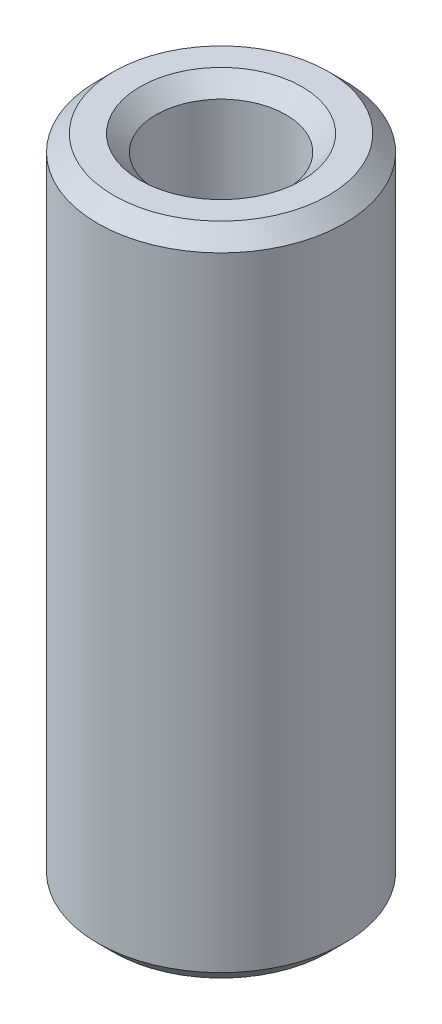
ISO-10303-21;
HEADER;
FILE_DESCRIPTION(('STEP AP214'),'2;1');
FILE_NAME('part.step','',(''),(''),'','','');
FILE_SCHEMA(('AUTOMOTIVE_DESIGN { 1 0 10303 214 1 1 1 1 }'));
ENDSEC;
DATA;
#1=APPLICATION_CONTEXT('core data for automotive mechanical design processes');
#2=APPLICATION_PROTOCOL_DEFINITION('international standard','automotive_design',2000,#1);
#3=PRODUCT_CONTEXT('',#1,'mechanical');
#4=PRODUCT('Part','Part','',(#3));
#5=PRODUCT_RELATED_PRODUCT_CATEGORY('part','',(#4));
#6=PRODUCT_DEFINITION_FORMATION('','',#4);
#7=PRODUCT_DEFINITION_CONTEXT('part definition',#1,'design');
#8=PRODUCT_DEFINITION('design','',#6,#7);
#9=PRODUCT_DEFINITION_SHAPE('','',#8);
#10=(LENGTH_UNIT() NAMED_UNIT(*) SI_UNIT(.MILLI.,.METRE.));
#11=(NAMED_UNIT(*) PLANE_ANGLE_UNIT() SI_UNIT($,.RADIAN.));
#12=(NAMED_UNIT(*) SI_UNIT($,.STERADIAN.) SOLID_ANGLE_UNIT());
#13=UNCERTAINTY_MEASURE_WITH_UNIT(LENGTH_MEASURE(1.E-05),#10,'distance_accuracy_value','');
#14=(GEOMETRIC_REPRESENTATION_CONTEXT(3) GLOBAL_UNCERTAINTY_ASSIGNED_CONTEXT((#13)) GLOBAL_UNIT_ASSIGNED_CONTEXT((#10,
#11,#12)) REPRESENTATION_CONTEXT('',''));
#15=CARTESIAN_POINT('',(0.,0.,0.));
#16=DIRECTION('',(0.,0.,1.));
#17=DIRECTION('',(1.,0.,0.));
#18=AXIS2_PLACEMENT_3D('',#15,#16,#17);
#19=CARTESIAN_POINT('',(0.,106.196778002073,0.));
#20=DIRECTION('',(0.,-1.,0.));
#21=DIRECTION('',(0.,0.,-1.));
#22=AXIS2_PLACEMENT_3D('',#19,#20,#21);
#23=CYLINDRICAL_SURFACE('',#22,20.);
#24=CARTESIAN_POINT('',(0.,2.61229125032107,0.));
#25=DIRECTION('',(0.,1.,0.));
#26=DIRECTION('',(0.,0.,1.));
#27=AXIS2_PLACEMENT_3D('',#24,#25,#26);
#28=CIRCLE('',#27,20.);
#29=CARTESIAN_POINT('',(0.,2.61229125032107,20.));
#30=VERTEX_POINT('',#29);
#31=EDGE_CURVE('E10',#30,#30,#28,.T.);
#32=ORIENTED_EDGE('',*,*,#31,.T.);
#33=EDGE_LOOP('',(#32));
#34=FACE_BOUND('',#33,.T.);
#35=CARTESIAN_POINT('',(0.,103.584486751752,0.));
#36=DIRECTION('',(0.,1.,0.));
#37=DIRECTION('',(0.,0.,1.));
#38=AXIS2_PLACEMENT_3D('',#35,#36,#37);
#39=CIRCLE('',#38,20.);
#40=CARTESIAN_POINT('',(0.,103.584486751752,20.));
#41=VERTEX_POINT('',#40);
#42=EDGE_CURVE('E50',#41,#41,#39,.F.);
#43=ORIENTED_EDGE('',*,*,#42,.T.);
#44=EDGE_LOOP('',(#43));
#45=FACE_BOUND('',#44,.T.);
#46=ADVANCED_FACE('F39',(#34,#45),#23,.T.);
#47=CARTESIAN_POINT('',(0.,106.196778002073,0.));
#48=DIRECTION('',(0.,1.,0.));
#49=DIRECTION('',(0.,0.,1.));
#50=AXIS2_PLACEMENT_3D('',#47,#48,#49);
#51=PLANE('',#50);
#52=CARTESIAN_POINT('',(0.,106.196778002073,0.));
#53=DIRECTION('',(0.,1.,0.));
#54=DIRECTION('',(0.,0.,1.));
#55=AXIS2_PLACEMENT_3D('',#52,#53,#54);
#56=CIRCLE('',#55,13.1264361179841);
#57=CARTESIAN_POINT('',(0.,106.196778002073,13.1264361179841));
#58=VERTEX_POINT('',#57);
#59=EDGE_CURVE('E58',#58,#58,#56,.F.);
#60=ORIENTED_EDGE('',*,*,#59,.T.);
#61=EDGE_LOOP('',(#60));
#62=FACE_BOUND('',#61,.T.);
#63=CARTESIAN_POINT('',(0.,106.196778002073,0.));
#64=DIRECTION('',(0.,1.,0.));
#65=DIRECTION('',(0.,0.,1.));
#66=AXIS2_PLACEMENT_3D('',#63,#64,#65);
#67=CIRCLE('',#66,17.3877087496789);
#68=CARTESIAN_POINT('',(0.,106.196778002073,17.3877087496789));
#69=VERTEX_POINT('',#68);
#70=EDGE_CURVE('E61',#69,#69,#67,.T.);
#71=ORIENTED_EDGE('',*,*,#70,.T.);
#72=EDGE_LOOP('',(#71));
#73=FACE_BOUND('',#72,.T.);
#74=ADVANCED_FACE('F88',(#62,#73),#51,.T.);
#75=CARTESIAN_POINT('',(0.,0.,0.));
#76=DIRECTION('',(0.,1.,0.));
#77=DIRECTION('',(0.,0.,1.));
#78=AXIS2_PLACEMENT_3D('',#75,#76,#77);
#79=PLANE('',#78);
#80=CARTESIAN_POINT('',(0.,0.,0.));
#81=DIRECTION('',(0.,1.,0.));
#82=DIRECTION('',(0.,0.,1.));
#83=AXIS2_PLACEMENT_3D('',#80,#81,#82);
#84=CIRCLE('',#83,13.1264361179841);
#85=CARTESIAN_POINT('',(0.,0.,-13.1264361179841));
#86=VERTEX_POINT('',#85);
#87=EDGE_CURVE('E51',#86,#86,#84,.T.);
#88=ORIENTED_EDGE('',*,*,#87,.T.);
#89=EDGE_LOOP('',(#88));
#90=FACE_BOUND('',#89,.T.);
#91=CARTESIAN_POINT('',(0.,0.,0.));
#92=DIRECTION('',(0.,1.,0.));
#93=DIRECTION('',(0.,0.,1.));
#94=AXIS2_PLACEMENT_3D('',#91,#92,#93);
#95=CIRCLE('',#94,17.3877087496789);
#96=CARTESIAN_POINT('',(0.,0.,17.3877087496789));
#97=VERTEX_POINT('',#96);
#98=EDGE_CURVE('E54',#97,#97,#95,.F.);
#99=ORIENTED_EDGE('',*,*,#98,.T.);
#100=EDGE_LOOP('',(#99));
#101=FACE_BOUND('',#100,.T.);
#102=ADVANCED_FACE('F83',(#90,#101),#79,.F.);
#103=CARTESIAN_POINT('',(0.,106.196778002073,0.));
#104=DIRECTION('',(0.,-1.,0.));
#105=DIRECTION('',(0.,0.,-1.));
#106=AXIS2_PLACEMENT_3D('',#103,#104,#105);
#107=CYLINDRICAL_SURFACE('',#106,10.514144867663);
#108=CARTESIAN_POINT('',(0.,103.584486751752,0.));
#109=DIRECTION('',(0.,1.,0.));
#110=DIRECTION('',(0.,0.,1.));
#111=AXIS2_PLACEMENT_3D('',#108,#109,#110);
#112=CIRCLE('',#111,10.514144867663);
#113=CARTESIAN_POINT('',(0.,103.584486751752,10.514144867663));
#114=VERTEX_POINT('',#113);
#115=EDGE_CURVE('E67',#114,#114,#112,.T.);
#116=ORIENTED_EDGE('',*,*,#115,.T.);
#117=EDGE_LOOP('',(#116));
#118=FACE_BOUND('',#117,.T.);
#119=CARTESIAN_POINT('',(0.,2.61229125032111,0.));
#120=DIRECTION('',(0.,1.,0.));
#121=DIRECTION('',(0.,0.,1.));
#122=AXIS2_PLACEMENT_3D('',#119,#120,#121);
#123=CIRCLE('',#122,10.514144867663);
#124=CARTESIAN_POINT('',(0.,2.61229125032111,-10.514144867663));
#125=VERTEX_POINT('',#124);
#126=EDGE_CURVE('E69',#125,#125,#123,.F.);
#127=ORIENTED_EDGE('',*,*,#126,.T.);
#128=EDGE_LOOP('',(#127));
#129=FACE_BOUND('',#128,.T.);
#130=ADVANCED_FACE('F71',(#118,#129),#107,.F.);
#131=CARTESIAN_POINT('',(0.,103.584486751752,0.));
#132=DIRECTION('',(0.,1.,0.));
#133=DIRECTION('',(0.,0.,1.));
#134=AXIS2_PLACEMENT_3D('',#131,#132,#133);
#135=CONICAL_SURFACE('',#134,10.514144867663,0.78539816339745);
#136=ORIENTED_EDGE('',*,*,#59,.F.);
#137=EDGE_LOOP('',(#136));
#138=FACE_BOUND('',#137,.T.);
#139=ORIENTED_EDGE('',*,*,#115,.F.);
#140=EDGE_LOOP('',(#139));
#141=FACE_BOUND('',#140,.T.);
#142=ADVANCED_FACE('F77',(#138,#141),#135,.F.);
#143=CARTESIAN_POINT('',(0.,0.,0.));
#144=DIRECTION('',(0.,-1.,0.));
#145=DIRECTION('',(0.,0.,-1.));
#146=AXIS2_PLACEMENT_3D('',#143,#144,#145);
#147=CONICAL_SURFACE('',#146,13.1264361179841,0.785398163397445);
#148=CARTESIAN_POINT('',(0.,2.61229125032111,-10.514144867663));
#149=CARTESIAN_POINT('',(0.,2.58507988313027,-10.5413562348539));
#150=CARTESIAN_POINT('',(0.,2.55786851593942,-10.5685676020447));
#151=CARTESIAN_POINT('',(0.,2.50344578155773,-10.6229903364264));
#152=CARTESIAN_POINT('',(0.,2.47623441436689,-10.6502017036172));
#153=CARTESIAN_POINT('',(0.,2.4218116799852,-10.7046244379989));
#154=CARTESIAN_POINT('',(0.,2.39460031279435,-10.7318358051898));
#155=CARTESIAN_POINT('',(0.,2.34017757841266,-10.7862585395715));
#156=CARTESIAN_POINT('',(0.,2.31296621122182,-10.8134699067623));
#157=CARTESIAN_POINT('',(0.,2.25854347684013,-10.867892641144));
#158=CARTESIAN_POINT('',(0.,2.23133210964928,-10.8951040083348));
#159=CARTESIAN_POINT('',(0.,2.17690937526759,-10.9495267427165));
#160=CARTESIAN_POINT('',(0.,2.14969800807675,-10.9767381099074));
#161=CARTESIAN_POINT('',(0.,2.09527527369506,-11.0311608442891));
#162=CARTESIAN_POINT('',(0.,2.06806390650421,-11.0583722114799));
#163=CARTESIAN_POINT('',(0.,2.01364117212252,-11.1127949458616));
#164=CARTESIAN_POINT('',(0.,1.98642980493168,-11.1400063130524));
#165=CARTESIAN_POINT('',(0.,1.93200707054999,-11.1944290474341));
#166=CARTESIAN_POINT('',(0.,1.90479570335915,-11.221640414625));
#167=CARTESIAN_POINT('',(0.,1.85037296897746,-11.2760631490067));
#168=CARTESIAN_POINT('',(0.,1.82316160178661,-11.3032745161975));
#169=CARTESIAN_POINT('',(0.,1.76873886740492,-11.3576972505792));
#170=CARTESIAN_POINT('',(0.,1.74152750021408,-11.38490861777));
#171=CARTESIAN_POINT('',(0.,1.68710476583239,-11.4393313521517));
#172=CARTESIAN_POINT('',(0.,1.65989339864154,-11.4665427193426));
#173=CARTESIAN_POINT('',(0.,1.60547066425985,-11.5209654537243));
#174=CARTESIAN_POINT('',(0.,1.57825929706901,-11.5481768209151));
#175=CARTESIAN_POINT('',(0.,1.52383656268732,-11.6025995552968));
#176=CARTESIAN_POINT('',(0.,1.49662519549647,-11.6298109224877));
#177=CARTESIAN_POINT('',(0.,1.44220246111478,-11.6842336568693));
#178=CARTESIAN_POINT('',(0.,1.41499109392394,-11.7114450240602));
#179=CARTESIAN_POINT('',(0.,1.36056835954225,-11.7658677584419));
#180=CARTESIAN_POINT('',(0.,1.3333569923514,-11.7930791256327));
#181=CARTESIAN_POINT('',(0.,1.27893425796971,-11.8475018600144));
#182=CARTESIAN_POINT('',(0.,1.25172289077887,-11.8747132272053));
#183=CARTESIAN_POINT('',(0.,1.19730015639718,-11.9291359615869));
#184=CARTESIAN_POINT('',(0.,1.17008878920633,-11.9563473287778));
#185=CARTESIAN_POINT('',(0.,1.11566605482464,-12.0107700631595));
#186=CARTESIAN_POINT('',(0.,1.0884546876338,-12.0379814303503));
#187=CARTESIAN_POINT('',(0.,1.03403195325211,-12.092404164732));
#188=CARTESIAN_POINT('',(0.,1.00682058606126,-12.1196155319229));
#189=CARTESIAN_POINT('',(0.,0.952397851679573,-12.1740382663045));
#190=CARTESIAN_POINT('',(0.,0.925186484488728,-12.2012496334954));
#191=CARTESIAN_POINT('',(0.,0.870763750107038,-12.2556723678771));
#192=CARTESIAN_POINT('',(0.,0.843552382916193,-12.2828837350679));
#193=CARTESIAN_POINT('',(0.,0.789129648534503,-12.3373064694496));
#194=CARTESIAN_POINT('',(0.,0.761918281343658,-12.3645178366405));
#195=CARTESIAN_POINT('',(0.,0.707495546961968,-12.4189405710221));
#196=CARTESIAN_POINT('',(0.,0.680284179771123,-12.446151938213));
#197=CARTESIAN_POINT('',(0.,0.625861445389434,-12.5005746725947));
#198=CARTESIAN_POINT('',(0.,0.598650078198589,-12.5277860397855));
#199=CARTESIAN_POINT('',(0.,0.544227343816899,-12.5822087741672));
#200=CARTESIAN_POINT('',(0.,0.517015976626054,-12.6094201413581));
#201=CARTESIAN_POINT('',(0.,0.462593242244364,-12.6638428757398));
#202=CARTESIAN_POINT('',(0.,0.435381875053519,-12.6910542429306));
#203=CARTESIAN_POINT('',(0.,0.380959140671829,-12.7454769773123));
#204=CARTESIAN_POINT('',(0.,0.353747773480984,-12.7726883445031));
#205=CARTESIAN_POINT('',(0.,0.299325039099294,-12.8271110788848));
#206=CARTESIAN_POINT('',(0.,0.272113671908449,-12.8543224460757));
#207=CARTESIAN_POINT('',(0.,0.217690937526759,-12.9087451804574));
#208=CARTESIAN_POINT('',(0.,0.190479570335915,-12.9359565476482));
#209=CARTESIAN_POINT('',(0.,0.136056835954225,-12.9903792820299));
#210=CARTESIAN_POINT('',(0.,0.10884546876338,-13.0175906492207));
#211=CARTESIAN_POINT('',(0.,0.0544227343816898,-13.0720133836024));
#212=CARTESIAN_POINT('',(0.,0.0272113671908448,-13.0992247507933));
#213=CARTESIAN_POINT('',(0.,0.,-13.1264361179841));
#214=B_SPLINE_CURVE_WITH_KNOTS('',3,(#148,#149,#150,#151,#152,#153,#154,#155,#156,#157,#158,
#159,#160,#161,#162,#163,#164,#165,#166,#167,#168,#169,#170,#171,#172,#173,#174,#175,#176,#177,
#178,#179,#180,#181,#182,#183,#184,#185,#186,#187,#188,#189,#190,#191,#192,#193,#194,#195,#196,
#197,#198,#199,#200,#201,#202,#203,#204,#205,#206,#207,#208,#209,#210,#211,#212,#213),
.UNSPECIFIED.,.F.,.F.,(4,2,2,2,2,2,2,2,2,2,2,2,2,2,2,2,2,2,2,2,2,2,2,2,2,2,2,2,2,2,2,2,4),(0.,
0.115448053596022,0.230896107192042,0.346344160788064,0.461792214384085,0.577240267980106,
0.692688321576127,0.808136375172148,0.92358442876817,1.03903248236419,1.15448053596021,
1.26992858955623,1.38537664315225,1.50082469674828,1.6162727503443,1.73172080394032,
1.84716885753634,1.96261691113236,2.07806496472838,2.1935130183244,2.30896107192042,
2.42440912551644,2.53985717911247,2.65530523270849,2.77075328630451,2.88620133990053,
3.00164939349655,3.11709744709257,3.23254550068859,3.34799355428461,3.46344160788064,
3.57888966147666,3.69433771507268),.UNSPECIFIED.);
#215=EDGE_CURVE('BSEAM73',#125,#86,#214,.T.);
#216=ORIENTED_EDGE('',*,*,#126,.F.);
#217=ORIENTED_EDGE('',*,*,#87,.F.);
#218=ORIENTED_EDGE('',*,*,#215,.T.);
#219=ORIENTED_EDGE('',*,*,#215,.F.);
#220=EDGE_LOOP('',(#216,#218,#217,#219));
#221=FACE_BOUND('',#220,.T.);
#222=ADVANCED_FACE('F73',(#221),#147,.F.);
#223=CARTESIAN_POINT('',(0.,2.61229125032107,0.));
#224=DIRECTION('',(0.,1.,0.));
#225=DIRECTION('',(0.,0.,1.));
#226=AXIS2_PLACEMENT_3D('',#223,#224,#225);
#227=CONICAL_SURFACE('',#226,20.,0.785398163397453);
#228=ORIENTED_EDGE('',*,*,#98,.F.);
#229=EDGE_LOOP('',(#228));
#230=FACE_BOUND('',#229,.T.);
#231=ORIENTED_EDGE('',*,*,#31,.F.);
#232=EDGE_LOOP('',(#231));
#233=FACE_BOUND('',#232,.T.);
#234=ADVANCED_FACE('F76',(#230,#233),#227,.T.);
#235=CARTESIAN_POINT('',(0.,106.196778002073,0.));
#236=DIRECTION('',(0.,-1.,0.));
#237=DIRECTION('',(0.,0.,-1.));
#238=AXIS2_PLACEMENT_3D('',#235,#236,#237);
#239=CONICAL_SURFACE('',#238,17.3877087496789,0.785398163397445);
#240=ORIENTED_EDGE('',*,*,#42,.F.);
#241=EDGE_LOOP('',(#240));
#242=FACE_BOUND('',#241,.T.);
#243=ORIENTED_EDGE('',*,*,#70,.F.);
#244=EDGE_LOOP('',(#243));
#245=FACE_BOUND('',#244,.T.);
#246=ADVANCED_FACE('F45',(#242,#245),#239,.T.);
#247=CLOSED_SHELL('',(#46,#74,#102,#130,#142,#222,#234,#246));
#248=MANIFOLD_SOLID_BREP('B2',#247);
#249=ADVANCED_BREP_SHAPE_REPRESENTATION('',(#18,#248),#14);
#250=SHAPE_DEFINITION_REPRESENTATION(#9,#249);
ENDSEC;
END-ISO-10303-21;
